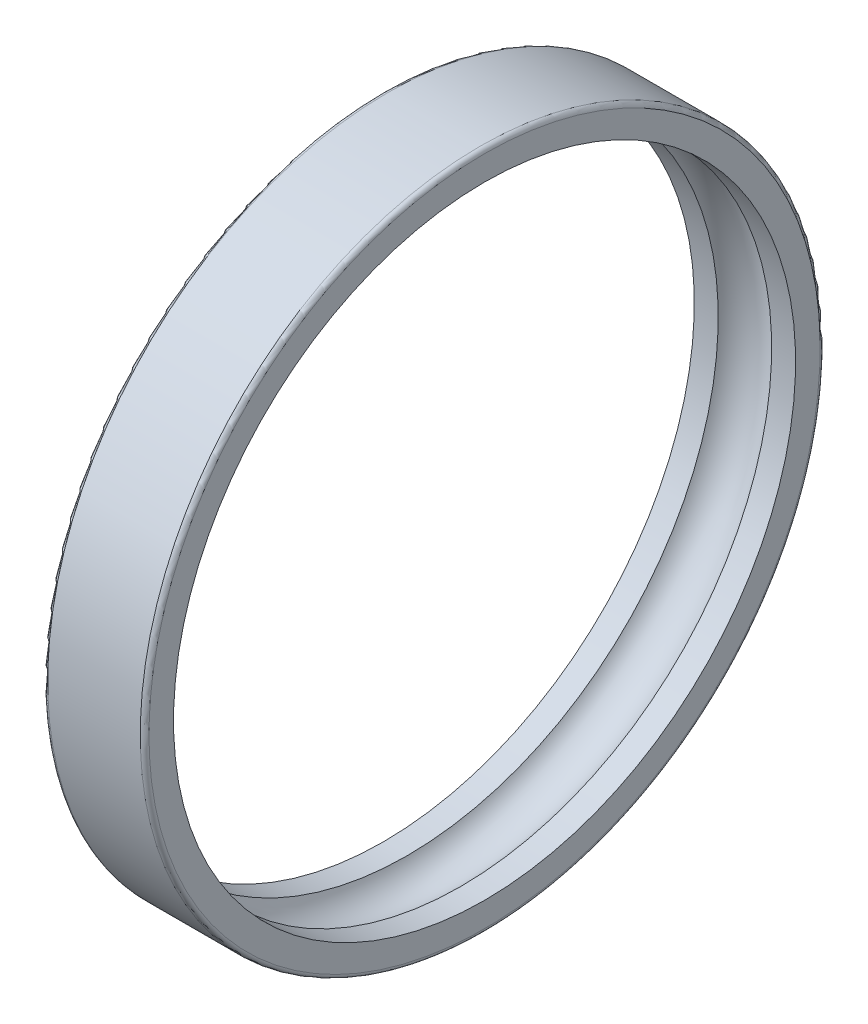
ISO-10303-21;
HEADER;
FILE_DESCRIPTION(('STEP AP214'),'2;1');
FILE_NAME('part.step','',(''),(''),'','','');
FILE_SCHEMA(('AUTOMOTIVE_DESIGN { 1 0 10303 214 1 1 1 1 }'));
ENDSEC;
DATA;
#1=APPLICATION_CONTEXT('core data for automotive mechanical design processes');
#2=APPLICATION_PROTOCOL_DEFINITION('international standard','automotive_design',2000,#1);
#3=PRODUCT_CONTEXT('',#1,'mechanical');
#4=PRODUCT('Part','Part','',(#3));
#5=PRODUCT_RELATED_PRODUCT_CATEGORY('part','',(#4));
#6=PRODUCT_DEFINITION_FORMATION('','',#4);
#7=PRODUCT_DEFINITION_CONTEXT('part definition',#1,'design');
#8=PRODUCT_DEFINITION('design','',#6,#7);
#9=PRODUCT_DEFINITION_SHAPE('','',#8);
#10=(LENGTH_UNIT() NAMED_UNIT(*) SI_UNIT(.MILLI.,.METRE.));
#11=(NAMED_UNIT(*) PLANE_ANGLE_UNIT() SI_UNIT($,.RADIAN.));
#12=(NAMED_UNIT(*) SI_UNIT($,.STERADIAN.) SOLID_ANGLE_UNIT());
#13=UNCERTAINTY_MEASURE_WITH_UNIT(LENGTH_MEASURE(1.E-05),#10,'distance_accuracy_value','');
#14=(GEOMETRIC_REPRESENTATION_CONTEXT(3) GLOBAL_UNCERTAINTY_ASSIGNED_CONTEXT((#13)) GLOBAL_UNIT_ASSIGNED_CONTEXT((#10,
#11,#12)) REPRESENTATION_CONTEXT('',''));
#15=CARTESIAN_POINT('',(0.,0.,0.));
#16=DIRECTION('',(0.,0.,1.));
#17=DIRECTION('',(1.,0.,0.));
#18=AXIS2_PLACEMENT_3D('',#15,#16,#17);
#19=CARTESIAN_POINT('',(0.,0.,0.));
#20=DIRECTION('',(1.,0.,0.));
#21=DIRECTION('',(0.,0.,-1.));
#22=AXIS2_PLACEMENT_3D('',#19,#20,#21);
#23=TOROIDAL_SURFACE('',#22,20.5,2.1);
#24=CARTESIAN_POINT('',(1.84661853126194,0.,0.));
#25=DIRECTION('',(1.,0.,0.));
#26=DIRECTION('',(0.,1.,0.));
#27=AXIS2_PLACEMENT_3D('',#24,#25,#26);
#28=CIRCLE('',#27,21.5);
#29=CARTESIAN_POINT('',(1.84661853126194,21.5,0.));
#30=VERTEX_POINT('',#29);
#31=EDGE_CURVE('E11',#30,#30,#28,.T.);
#32=ORIENTED_EDGE('',*,*,#31,.T.);
#33=EDGE_LOOP('',(#32));
#34=FACE_BOUND('',#33,.T.);
#35=CARTESIAN_POINT('',(-1.84661853126194,0.,0.));
#36=DIRECTION('',(1.,0.,0.));
#37=DIRECTION('',(0.,1.,0.));
#38=AXIS2_PLACEMENT_3D('',#35,#36,#37);
#39=CIRCLE('',#38,21.5);
#40=CARTESIAN_POINT('',(-1.84661853126194,21.5,0.));
#41=VERTEX_POINT('',#40);
#42=EDGE_CURVE('E48',#41,#41,#39,.T.);
#43=ORIENTED_EDGE('',*,*,#42,.F.);
#44=EDGE_LOOP('',(#43));
#45=FACE_BOUND('',#44,.T.);
#46=ADVANCED_FACE('F16',(#34,#45),#23,.F.);
#47=CARTESIAN_POINT('',(2.67330926563097,0.,0.));
#48=DIRECTION('',(-1.,0.,0.));
#49=DIRECTION('',(0.,1.,0.));
#50=AXIS2_PLACEMENT_3D('',#47,#48,#49);
#51=CYLINDRICAL_SURFACE('',#50,21.5);
#52=CARTESIAN_POINT('',(3.5,0.,0.));
#53=DIRECTION('',(1.,0.,0.));
#54=DIRECTION('',(0.,1.,0.));
#55=AXIS2_PLACEMENT_3D('',#52,#53,#54);
#56=CIRCLE('',#55,21.5);
#57=CARTESIAN_POINT('',(3.5,21.5,0.));
#58=VERTEX_POINT('',#57);
#59=EDGE_CURVE('E25',#58,#58,#56,.T.);
#60=ORIENTED_EDGE('',*,*,#59,.T.);
#61=EDGE_LOOP('',(#60));
#62=FACE_BOUND('',#61,.T.);
#63=ORIENTED_EDGE('',*,*,#31,.F.);
#64=EDGE_LOOP('',(#63));
#65=FACE_BOUND('',#64,.T.);
#66=ADVANCED_FACE('F18',(#62,#65),#51,.F.);
#67=CARTESIAN_POINT('',(3.5,22.35,0.));
#68=DIRECTION('',(1.,0.,0.));
#69=DIRECTION('',(0.,1.,0.));
#70=AXIS2_PLACEMENT_3D('',#67,#68,#69);
#71=PLANE('',#70);
#72=CARTESIAN_POINT('',(3.5,0.,0.));
#73=DIRECTION('',(1.,0.,0.));
#74=DIRECTION('',(0.,1.,0.));
#75=AXIS2_PLACEMENT_3D('',#72,#73,#74);
#76=CIRCLE('',#75,23.2);
#77=CARTESIAN_POINT('',(3.5,23.2,0.));
#78=VERTEX_POINT('',#77);
#79=EDGE_CURVE('E59',#78,#78,#76,.T.);
#80=ORIENTED_EDGE('',*,*,#79,.T.);
#81=EDGE_LOOP('',(#80));
#82=FACE_BOUND('',#81,.T.);
#83=ORIENTED_EDGE('',*,*,#59,.F.);
#84=EDGE_LOOP('',(#83));
#85=FACE_BOUND('',#84,.T.);
#86=ADVANCED_FACE('F86',(#82,#85),#71,.T.);
#87=CARTESIAN_POINT('',(3.2,0.,0.));
#88=DIRECTION('',(1.,0.,0.));
#89=DIRECTION('',(0.,0.,-1.));
#90=AXIS2_PLACEMENT_3D('',#87,#88,#89);
#91=TOROIDAL_SURFACE('',#90,23.2,0.3);
#92=CARTESIAN_POINT('',(3.2,0.,0.));
#93=DIRECTION('',(1.,0.,0.));
#94=DIRECTION('',(0.,1.,0.));
#95=AXIS2_PLACEMENT_3D('',#92,#93,#94);
#96=CIRCLE('',#95,23.5);
#97=CARTESIAN_POINT('',(3.2,23.5,0.));
#98=VERTEX_POINT('',#97);
#99=EDGE_CURVE('E55',#98,#98,#96,.T.);
#100=ORIENTED_EDGE('',*,*,#99,.T.);
#101=EDGE_LOOP('',(#100));
#102=FACE_BOUND('',#101,.T.);
#103=ORIENTED_EDGE('',*,*,#79,.F.);
#104=EDGE_LOOP('',(#103));
#105=FACE_BOUND('',#104,.T.);
#106=ADVANCED_FACE('F56',(#102,#105),#91,.T.);
#107=CARTESIAN_POINT('',(0.,0.,0.));
#108=DIRECTION('',(-1.,0.,0.));
#109=DIRECTION('',(0.,1.,0.));
#110=AXIS2_PLACEMENT_3D('',#107,#108,#109);
#111=CYLINDRICAL_SURFACE('',#110,23.5);
#112=CARTESIAN_POINT('',(-3.2,0.,0.));
#113=DIRECTION('',(1.,0.,0.));
#114=DIRECTION('',(0.,1.,0.));
#115=AXIS2_PLACEMENT_3D('',#112,#113,#114);
#116=CIRCLE('',#115,23.5);
#117=CARTESIAN_POINT('',(-3.2,23.5,0.));
#118=VERTEX_POINT('',#117);
#119=EDGE_CURVE('E60',#118,#118,#116,.T.);
#120=ORIENTED_EDGE('',*,*,#119,.T.);
#121=EDGE_LOOP('',(#120));
#122=FACE_BOUND('',#121,.T.);
#123=ORIENTED_EDGE('',*,*,#99,.F.);
#124=EDGE_LOOP('',(#123));
#125=FACE_BOUND('',#124,.T.);
#126=ADVANCED_FACE('F101',(#122,#125),#111,.T.);
#127=CARTESIAN_POINT('',(-3.2,0.,0.));
#128=DIRECTION('',(1.,0.,0.));
#129=DIRECTION('',(0.,0.,-1.));
#130=AXIS2_PLACEMENT_3D('',#127,#128,#129);
#131=TOROIDAL_SURFACE('',#130,23.2,0.3);
#132=CARTESIAN_POINT('',(-3.5,0.,0.));
#133=DIRECTION('',(1.,0.,0.));
#134=DIRECTION('',(0.,1.,0.));
#135=AXIS2_PLACEMENT_3D('',#132,#133,#134);
#136=CIRCLE('',#135,23.2);
#137=CARTESIAN_POINT('',(-3.5,23.2,0.));
#138=VERTEX_POINT('',#137);
#139=EDGE_CURVE('E42',#138,#138,#136,.T.);
#140=ORIENTED_EDGE('',*,*,#139,.T.);
#141=EDGE_LOOP('',(#140));
#142=FACE_BOUND('',#141,.T.);
#143=ORIENTED_EDGE('',*,*,#119,.F.);
#144=EDGE_LOOP('',(#143));
#145=FACE_BOUND('',#144,.T.);
#146=ADVANCED_FACE('F79',(#142,#145),#131,.T.);
#147=CARTESIAN_POINT('',(-3.5,22.35,0.));
#148=DIRECTION('',(-1.,0.,0.));
#149=DIRECTION('',(0.,-1.,0.));
#150=AXIS2_PLACEMENT_3D('',#147,#148,#149);
#151=PLANE('',#150);
#152=CARTESIAN_POINT('',(-3.5,0.,0.));
#153=DIRECTION('',(1.,0.,0.));
#154=DIRECTION('',(0.,1.,0.));
#155=AXIS2_PLACEMENT_3D('',#152,#153,#154);
#156=CIRCLE('',#155,21.5);
#157=CARTESIAN_POINT('',(-3.5,21.5,0.));
#158=VERTEX_POINT('',#157);
#159=EDGE_CURVE('E66',#158,#158,#156,.T.);
#160=ORIENTED_EDGE('',*,*,#159,.T.);
#161=EDGE_LOOP('',(#160));
#162=FACE_BOUND('',#161,.T.);
#163=ORIENTED_EDGE('',*,*,#139,.F.);
#164=EDGE_LOOP('',(#163));
#165=FACE_BOUND('',#164,.T.);
#166=ADVANCED_FACE('F69',(#162,#165),#151,.T.);
#167=CARTESIAN_POINT('',(-2.67330926563097,0.,0.));
#168=DIRECTION('',(-1.,0.,0.));
#169=DIRECTION('',(0.,1.,0.));
#170=AXIS2_PLACEMENT_3D('',#167,#168,#169);
#171=CYLINDRICAL_SURFACE('',#170,21.5);
#172=ORIENTED_EDGE('',*,*,#42,.T.);
#173=EDGE_LOOP('',(#172));
#174=FACE_BOUND('',#173,.T.);
#175=ORIENTED_EDGE('',*,*,#159,.F.);
#176=EDGE_LOOP('',(#175));
#177=FACE_BOUND('',#176,.T.);
#178=ADVANCED_FACE('F72',(#174,#177),#171,.F.);
#179=CLOSED_SHELL('',(#46,#66,#86,#106,#126,#146,#166,#178));
#180=MANIFOLD_SOLID_BREP('B1',#179);
#181=ADVANCED_BREP_SHAPE_REPRESENTATION('',(#18,#180),#14);
#182=SHAPE_DEFINITION_REPRESENTATION(#9,#181);
ENDSEC;
END-ISO-10303-21;
